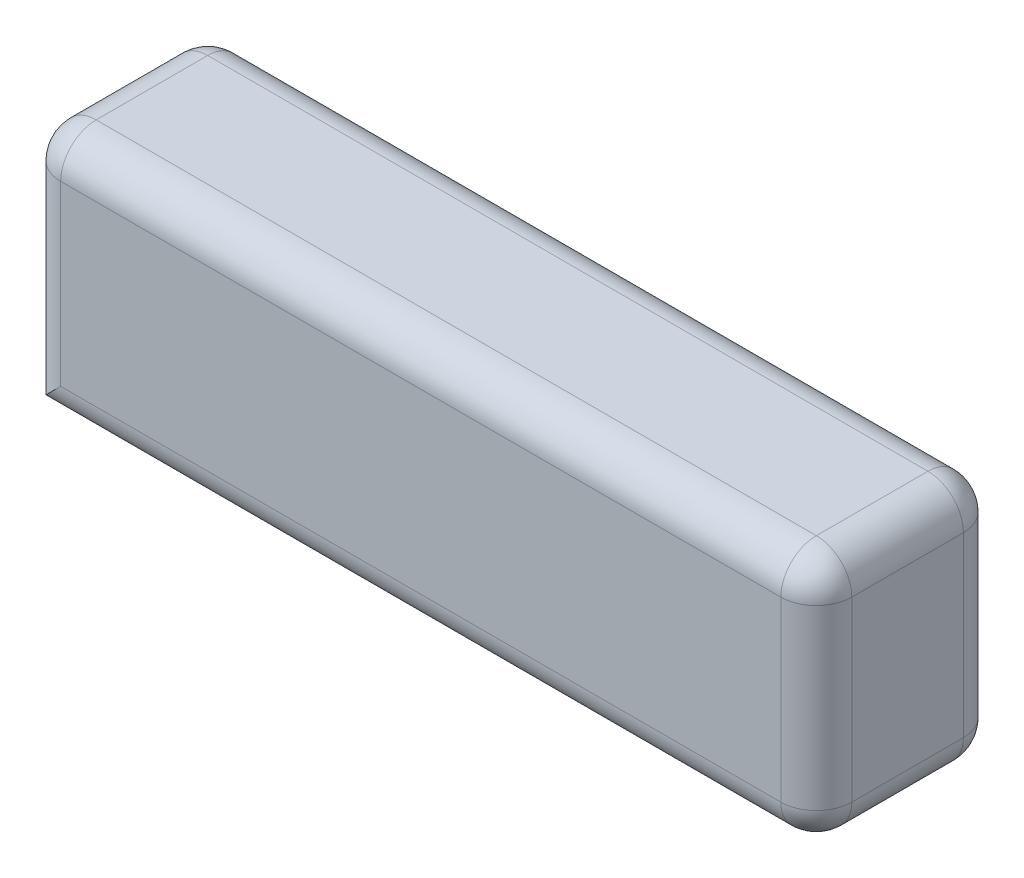
ISO-10303-21;
HEADER;
FILE_DESCRIPTION(('STEP AP214'),'2;1');
FILE_NAME('part.step','',(''),(''),'','','');
FILE_SCHEMA(('AUTOMOTIVE_DESIGN { 1 0 10303 214 1 1 1 1 }'));
ENDSEC;
DATA;
#1=APPLICATION_CONTEXT('core data for automotive mechanical design processes');
#2=APPLICATION_PROTOCOL_DEFINITION('international standard','automotive_design',2000,#1);
#3=PRODUCT_CONTEXT('',#1,'mechanical');
#4=PRODUCT('Part','Part','',(#3));
#5=PRODUCT_RELATED_PRODUCT_CATEGORY('part','',(#4));
#6=PRODUCT_DEFINITION_FORMATION('','',#4);
#7=PRODUCT_DEFINITION_CONTEXT('part definition',#1,'design');
#8=PRODUCT_DEFINITION('design','',#6,#7);
#9=PRODUCT_DEFINITION_SHAPE('','',#8);
#10=(LENGTH_UNIT() NAMED_UNIT(*) SI_UNIT(.MILLI.,.METRE.));
#11=(NAMED_UNIT(*) PLANE_ANGLE_UNIT() SI_UNIT($,.RADIAN.));
#12=(NAMED_UNIT(*) SI_UNIT($,.STERADIAN.) SOLID_ANGLE_UNIT());
#13=UNCERTAINTY_MEASURE_WITH_UNIT(LENGTH_MEASURE(1.E-05),#10,'distance_accuracy_value','');
#14=(GEOMETRIC_REPRESENTATION_CONTEXT(3) GLOBAL_UNCERTAINTY_ASSIGNED_CONTEXT((#13)) GLOBAL_UNIT_ASSIGNED_CONTEXT((#10,
#11,#12)) REPRESENTATION_CONTEXT('',''));
#15=CARTESIAN_POINT('',(0.,0.,0.));
#16=DIRECTION('',(0.,0.,1.));
#17=DIRECTION('',(1.,0.,0.));
#18=AXIS2_PLACEMENT_3D('',#15,#16,#17);
#19=CARTESIAN_POINT('',(0.,0.,36.));
#20=DIRECTION('',(1.,0.,0.));
#21=DIRECTION('',(0.,0.,-1.));
#22=AXIS2_PLACEMENT_3D('',#19,#20,#21);
#23=PLANE('',#22);
#24=DIRECTION('',(0.,0.,-1.));
#25=VECTOR('',#24,1.);
#26=CARTESIAN_POINT('',(0.,42.,36.));
#27=LINE('',#26,#25);
#28=CARTESIAN_POINT('',(0.,42.,29.));
#29=VERTEX_POINT('',#28);
#30=CARTESIAN_POINT('',(0.,42.,7.));
#31=VERTEX_POINT('',#30);
#32=EDGE_CURVE('E154',#29,#31,#27,.T.);
#33=ORIENTED_EDGE('',*,*,#32,.T.);
#34=DIRECTION('',(0.,-1.,0.));
#35=VECTOR('',#34,1.);
#36=CARTESIAN_POINT('',(0.,0.,7.));
#37=LINE('',#36,#35);
#38=CARTESIAN_POINT('',(0.,0.,7.));
#39=VERTEX_POINT('',#38);
#40=EDGE_CURVE('E138',#31,#39,#37,.T.);
#41=ORIENTED_EDGE('',*,*,#40,.T.);
#42=DIRECTION('',(0.,0.,-1.));
#43=VECTOR('',#42,1.);
#44=CARTESIAN_POINT('',(0.,0.,36.));
#45=LINE('',#44,#43);
#46=CARTESIAN_POINT('',(0.,0.,29.));
#47=VERTEX_POINT('',#46);
#48=EDGE_CURVE('E123',#47,#39,#45,.T.);
#49=ORIENTED_EDGE('',*,*,#48,.F.);
#50=DIRECTION('',(0.,-1.,0.));
#51=VECTOR('',#50,1.);
#52=CARTESIAN_POINT('',(0.,0.,29.));
#53=LINE('',#52,#51);
#54=EDGE_CURVE('E135',#47,#29,#53,.F.);
#55=ORIENTED_EDGE('',*,*,#54,.T.);
#56=EDGE_LOOP('',(#33,#41,#49,#55));
#57=FACE_BOUND('',#56,.T.);
#58=ADVANCED_FACE('F34',(#57),#23,.F.);
#59=CARTESIAN_POINT('',(0.,0.,36.));
#60=DIRECTION('',(0.,1.,0.));
#61=DIRECTION('',(0.,0.,1.));
#62=AXIS2_PLACEMENT_3D('',#59,#60,#61);
#63=PLANE('',#62);
#64=ORIENTED_EDGE('',*,*,#48,.T.);
#65=DIRECTION('',(1.,0.,0.));
#66=VECTOR('',#65,1.);
#67=CARTESIAN_POINT('',(156.,0.,7.));
#68=LINE('',#67,#66);
#69=CARTESIAN_POINT('',(149.,0.,7.));
#70=VERTEX_POINT('',#69);
#71=EDGE_CURVE('E130',#39,#70,#68,.T.);
#72=ORIENTED_EDGE('',*,*,#71,.T.);
#73=DIRECTION('',(0.,0.,-1.));
#74=VECTOR('',#73,1.);
#75=CARTESIAN_POINT('',(149.,0.,36.));
#76=LINE('',#75,#74);
#77=CARTESIAN_POINT('',(149.,0.,29.));
#78=VERTEX_POINT('',#77);
#79=EDGE_CURVE('E125',#70,#78,#76,.F.);
#80=ORIENTED_EDGE('',*,*,#79,.T.);
#81=DIRECTION('',(1.,0.,0.));
#82=VECTOR('',#81,1.);
#83=CARTESIAN_POINT('',(0.,0.,29.));
#84=LINE('',#83,#82);
#85=EDGE_CURVE('E120',#78,#47,#84,.F.);
#86=ORIENTED_EDGE('',*,*,#85,.T.);
#87=EDGE_LOOP('',(#64,#72,#80,#86));
#88=FACE_BOUND('',#87,.T.);
#89=ADVANCED_FACE('F122',(#88),#63,.F.);
#90=CARTESIAN_POINT('',(156.,0.,36.));
#91=DIRECTION('',(-1.,0.,0.));
#92=DIRECTION('',(0.,0.,1.));
#93=AXIS2_PLACEMENT_3D('',#90,#91,#92);
#94=PLANE('',#93);
#95=DIRECTION('',(0.,1.,0.));
#96=VECTOR('',#95,1.);
#97=CARTESIAN_POINT('',(156.,0.,29.));
#98=LINE('',#97,#96);
#99=CARTESIAN_POINT('',(156.,42.,29.));
#100=VERTEX_POINT('',#99);
#101=CARTESIAN_POINT('',(156.,7.,29.));
#102=VERTEX_POINT('',#101);
#103=EDGE_CURVE('E43',#100,#102,#98,.F.);
#104=ORIENTED_EDGE('',*,*,#103,.T.);
#105=DIRECTION('',(0.,0.,-1.));
#106=VECTOR('',#105,1.);
#107=CARTESIAN_POINT('',(156.,7.,36.));
#108=LINE('',#107,#106);
#109=CARTESIAN_POINT('',(156.,7.,7.));
#110=VERTEX_POINT('',#109);
#111=EDGE_CURVE('E11',#102,#110,#108,.T.);
#112=ORIENTED_EDGE('',*,*,#111,.T.);
#113=DIRECTION('',(0.,1.,0.));
#114=VECTOR('',#113,1.);
#115=CARTESIAN_POINT('',(156.,49.,7.));
#116=LINE('',#115,#114);
#117=CARTESIAN_POINT('',(156.,42.,7.));
#118=VERTEX_POINT('',#117);
#119=EDGE_CURVE('E188',#110,#118,#116,.T.);
#120=ORIENTED_EDGE('',*,*,#119,.T.);
#121=DIRECTION('',(0.,0.,-1.));
#122=VECTOR('',#121,1.);
#123=CARTESIAN_POINT('',(156.,42.,36.));
#124=LINE('',#123,#122);
#125=EDGE_CURVE('E186',#118,#100,#124,.F.);
#126=ORIENTED_EDGE('',*,*,#125,.T.);
#127=EDGE_LOOP('',(#104,#112,#120,#126));
#128=FACE_BOUND('',#127,.T.);
#129=ADVANCED_FACE('F260',(#128),#94,.F.);
#130=CARTESIAN_POINT('',(0.,49.,36.));
#131=DIRECTION('',(0.,-1.,0.));
#132=DIRECTION('',(0.,0.,-1.));
#133=AXIS2_PLACEMENT_3D('',#130,#131,#132);
#134=PLANE('',#133);
#135=DIRECTION('',(-1.,0.,0.));
#136=VECTOR('',#135,1.);
#137=CARTESIAN_POINT('',(0.,49.,7.));
#138=LINE('',#137,#136);
#139=CARTESIAN_POINT('',(149.,49.,7.));
#140=VERTEX_POINT('',#139);
#141=CARTESIAN_POINT('',(7.,49.,7.));
#142=VERTEX_POINT('',#141);
#143=EDGE_CURVE('E174',#140,#142,#138,.T.);
#144=ORIENTED_EDGE('',*,*,#143,.T.);
#145=DIRECTION('',(0.,0.,-1.));
#146=VECTOR('',#145,1.);
#147=CARTESIAN_POINT('',(7.,49.,36.));
#148=LINE('',#147,#146);
#149=CARTESIAN_POINT('',(7.,49.,29.));
#150=VERTEX_POINT('',#149);
#151=EDGE_CURVE('E176',#142,#150,#148,.F.);
#152=ORIENTED_EDGE('',*,*,#151,.T.);
#153=DIRECTION('',(-1.,0.,0.));
#154=VECTOR('',#153,1.);
#155=CARTESIAN_POINT('',(0.,49.,29.));
#156=LINE('',#155,#154);
#157=CARTESIAN_POINT('',(149.,49.,29.));
#158=VERTEX_POINT('',#157);
#159=EDGE_CURVE('E172',#150,#158,#156,.F.);
#160=ORIENTED_EDGE('',*,*,#159,.T.);
#161=DIRECTION('',(0.,0.,-1.));
#162=VECTOR('',#161,1.);
#163=CARTESIAN_POINT('',(149.,49.,36.));
#164=LINE('',#163,#162);
#165=EDGE_CURVE('E170',#158,#140,#164,.T.);
#166=ORIENTED_EDGE('',*,*,#165,.T.);
#167=EDGE_LOOP('',(#144,#152,#160,#166));
#168=FACE_BOUND('',#167,.T.);
#169=ADVANCED_FACE('F252',(#168),#134,.F.);
#170=CARTESIAN_POINT('',(0.,0.,36.));
#171=DIRECTION('',(0.,0.,-1.));
#172=DIRECTION('',(-1.,0.,0.));
#173=AXIS2_PLACEMENT_3D('',#170,#171,#172);
#174=PLANE('',#173);
#175=DIRECTION('',(-1.,0.,0.));
#176=VECTOR('',#175,1.);
#177=CARTESIAN_POINT('',(0.,42.,36.));
#178=LINE('',#177,#176);
#179=CARTESIAN_POINT('',(149.,42.,36.));
#180=VERTEX_POINT('',#179);
#181=CARTESIAN_POINT('',(7.,42.,36.));
#182=VERTEX_POINT('',#181);
#183=EDGE_CURVE('E179',#180,#182,#178,.T.);
#184=ORIENTED_EDGE('',*,*,#183,.T.);
#185=DIRECTION('',(0.,-1.,0.));
#186=VECTOR('',#185,1.);
#187=CARTESIAN_POINT('',(7.,0.,36.));
#188=LINE('',#187,#186);
#189=CARTESIAN_POINT('',(7.,7.,36.));
#190=VERTEX_POINT('',#189);
#191=EDGE_CURVE('E184',#182,#190,#188,.T.);
#192=ORIENTED_EDGE('',*,*,#191,.T.);
#193=DIRECTION('',(1.,0.,0.));
#194=VECTOR('',#193,1.);
#195=CARTESIAN_POINT('',(0.,7.,36.));
#196=LINE('',#195,#194);
#197=CARTESIAN_POINT('',(149.,7.,36.));
#198=VERTEX_POINT('',#197);
#199=EDGE_CURVE('E143',#190,#198,#196,.T.);
#200=ORIENTED_EDGE('',*,*,#199,.T.);
#201=DIRECTION('',(0.,1.,0.));
#202=VECTOR('',#201,1.);
#203=CARTESIAN_POINT('',(149.,0.,36.));
#204=LINE('',#203,#202);
#205=EDGE_CURVE('E181',#198,#180,#204,.T.);
#206=ORIENTED_EDGE('',*,*,#205,.T.);
#207=EDGE_LOOP('',(#184,#192,#200,#206));
#208=FACE_BOUND('',#207,.T.);
#209=ADVANCED_FACE('F249',(#208),#174,.F.);
#210=CARTESIAN_POINT('',(0.,0.,0.));
#211=DIRECTION('',(0.,0.,-1.));
#212=DIRECTION('',(-1.,0.,0.));
#213=AXIS2_PLACEMENT_3D('',#210,#211,#212);
#214=PLANE('',#213);
#215=DIRECTION('',(1.,0.,0.));
#216=VECTOR('',#215,1.);
#217=CARTESIAN_POINT('',(0.,7.,0.));
#218=LINE('',#217,#216);
#219=CARTESIAN_POINT('',(149.,7.,0.));
#220=VERTEX_POINT('',#219);
#221=CARTESIAN_POINT('',(7.,7.,0.));
#222=VERTEX_POINT('',#221);
#223=EDGE_CURVE('E163',#220,#222,#218,.F.);
#224=ORIENTED_EDGE('',*,*,#223,.T.);
#225=DIRECTION('',(0.,-1.,0.));
#226=VECTOR('',#225,1.);
#227=CARTESIAN_POINT('',(7.,49.,0.));
#228=LINE('',#227,#226);
#229=CARTESIAN_POINT('',(7.,42.,0.));
#230=VERTEX_POINT('',#229);
#231=EDGE_CURVE('E165',#222,#230,#228,.F.);
#232=ORIENTED_EDGE('',*,*,#231,.T.);
#233=DIRECTION('',(-1.,0.,0.));
#234=VECTOR('',#233,1.);
#235=CARTESIAN_POINT('',(156.,42.,0.));
#236=LINE('',#235,#234);
#237=CARTESIAN_POINT('',(149.,42.,0.));
#238=VERTEX_POINT('',#237);
#239=EDGE_CURVE('E159',#230,#238,#236,.F.);
#240=ORIENTED_EDGE('',*,*,#239,.T.);
#241=DIRECTION('',(0.,1.,0.));
#242=VECTOR('',#241,1.);
#243=CARTESIAN_POINT('',(149.,0.,0.));
#244=LINE('',#243,#242);
#245=EDGE_CURVE('E161',#238,#220,#244,.F.);
#246=ORIENTED_EDGE('',*,*,#245,.T.);
#247=EDGE_LOOP('',(#224,#232,#240,#246));
#248=FACE_BOUND('',#247,.T.);
#249=ADVANCED_FACE('F251',(#248),#214,.T.);
#250=CARTESIAN_POINT('',(149.,42.,29.));
#251=DIRECTION('',(0.,0.,1.));
#252=DIRECTION('',(1.,0.,0.));
#253=AXIS2_PLACEMENT_3D('',#250,#251,#252);
#254=SPHERICAL_SURFACE('',#253,7.);
#255=CARTESIAN_POINT('',(149.,42.,29.));
#256=DIRECTION('',(1.,0.,0.));
#257=DIRECTION('',(0.,0.,-1.));
#258=AXIS2_PLACEMENT_3D('',#255,#256,#257);
#259=CIRCLE('',#258,7.);
#260=EDGE_CURVE('E147',#180,#158,#259,.F.);
#261=ORIENTED_EDGE('',*,*,#260,.F.);
#262=CARTESIAN_POINT('',(149.,42.,29.));
#263=DIRECTION('',(0.,1.,0.));
#264=DIRECTION('',(0.,0.,1.));
#265=AXIS2_PLACEMENT_3D('',#262,#263,#264);
#266=CIRCLE('',#265,7.);
#267=EDGE_CURVE('E38',#100,#180,#266,.F.);
#268=ORIENTED_EDGE('',*,*,#267,.F.);
#269=CARTESIAN_POINT('',(149.,42.,29.));
#270=DIRECTION('',(0.,0.,1.));
#271=DIRECTION('',(1.,0.,0.));
#272=AXIS2_PLACEMENT_3D('',#269,#270,#271);
#273=CIRCLE('',#272,7.);
#274=EDGE_CURVE('E230',#158,#100,#273,.F.);
#275=ORIENTED_EDGE('',*,*,#274,.F.);
#276=EDGE_LOOP('',(#261,#268,#275));
#277=FACE_BOUND('',#276,.T.);
#278=ADVANCED_FACE('F36',(#277),#254,.T.);
#279=CARTESIAN_POINT('',(0.,7.,29.));
#280=DIRECTION('',(1.,0.,0.));
#281=DIRECTION('',(0.,0.,-1.));
#282=AXIS2_PLACEMENT_3D('',#279,#280,#281);
#283=CYLINDRICAL_SURFACE('',#282,7.);
#284=CARTESIAN_POINT('',(149.,7.,29.));
#285=DIRECTION('',(1.,0.,0.));
#286=DIRECTION('',(0.,0.,-1.));
#287=AXIS2_PLACEMENT_3D('',#284,#285,#286);
#288=CIRCLE('',#287,7.);
#289=EDGE_CURVE('E148',#198,#78,#288,.T.);
#290=ORIENTED_EDGE('',*,*,#289,.F.);
#291=ORIENTED_EDGE('',*,*,#199,.F.);
#292=CARTESIAN_POINT('',(7.,7.,29.));
#293=DIRECTION('',(0.707106781186547,-0.707106781186547,0.));
#294=DIRECTION('',(0.707106781186547,0.707106781186547,0.));
#295=AXIS2_PLACEMENT_3D('',#292,#293,#294);
#296=ELLIPSE('',#295,9.89949493661167,7.);
#297=EDGE_CURVE('E141',#47,#190,#296,.F.);
#298=ORIENTED_EDGE('',*,*,#297,.F.);
#299=ORIENTED_EDGE('',*,*,#85,.F.);
#300=EDGE_LOOP('',(#290,#291,#298,#299));
#301=FACE_BOUND('',#300,.T.);
#302=ADVANCED_FACE('F142',(#301),#283,.T.);
#303=CARTESIAN_POINT('',(149.,0.,29.));
#304=DIRECTION('',(0.,1.,0.));
#305=DIRECTION('',(0.,0.,1.));
#306=AXIS2_PLACEMENT_3D('',#303,#304,#305);
#307=CYLINDRICAL_SURFACE('',#306,7.);
#308=ORIENTED_EDGE('',*,*,#267,.T.);
#309=ORIENTED_EDGE('',*,*,#205,.F.);
#310=CARTESIAN_POINT('',(149.,7.,29.));
#311=DIRECTION('',(0.,-1.,0.));
#312=DIRECTION('',(0.,0.,-1.));
#313=AXIS2_PLACEMENT_3D('',#310,#311,#312);
#314=CIRCLE('',#313,7.);
#315=EDGE_CURVE('E225',#102,#198,#314,.T.);
#316=ORIENTED_EDGE('',*,*,#315,.F.);
#317=ORIENTED_EDGE('',*,*,#103,.F.);
#318=EDGE_LOOP('',(#308,#309,#316,#317));
#319=FACE_BOUND('',#318,.T.);
#320=ADVANCED_FACE('F241',(#319),#307,.T.);
#321=CARTESIAN_POINT('',(149.,42.,36.));
#322=DIRECTION('',(0.,0.,-1.));
#323=DIRECTION('',(-1.,0.,0.));
#324=AXIS2_PLACEMENT_3D('',#321,#322,#323);
#325=CYLINDRICAL_SURFACE('',#324,7.);
#326=ORIENTED_EDGE('',*,*,#274,.T.);
#327=ORIENTED_EDGE('',*,*,#125,.F.);
#328=CARTESIAN_POINT('',(149.,42.,7.));
#329=DIRECTION('',(0.,0.,-1.));
#330=DIRECTION('',(-1.,0.,0.));
#331=AXIS2_PLACEMENT_3D('',#328,#329,#330);
#332=CIRCLE('',#331,7.);
#333=EDGE_CURVE('E222',#140,#118,#332,.T.);
#334=ORIENTED_EDGE('',*,*,#333,.F.);
#335=ORIENTED_EDGE('',*,*,#165,.F.);
#336=EDGE_LOOP('',(#326,#327,#334,#335));
#337=FACE_BOUND('',#336,.T.);
#338=ADVANCED_FACE('F318',(#337),#325,.T.);
#339=CARTESIAN_POINT('',(0.,42.,29.));
#340=DIRECTION('',(-1.,0.,0.));
#341=DIRECTION('',(0.,0.,1.));
#342=AXIS2_PLACEMENT_3D('',#339,#340,#341);
#343=CYLINDRICAL_SURFACE('',#342,7.);
#344=ORIENTED_EDGE('',*,*,#260,.T.);
#345=ORIENTED_EDGE('',*,*,#159,.F.);
#346=CARTESIAN_POINT('',(7.,42.,29.));
#347=DIRECTION('',(-1.,0.,0.));
#348=DIRECTION('',(0.,0.,1.));
#349=AXIS2_PLACEMENT_3D('',#346,#347,#348);
#350=CIRCLE('',#349,7.);
#351=EDGE_CURVE('E219',#182,#150,#350,.T.);
#352=ORIENTED_EDGE('',*,*,#351,.F.);
#353=ORIENTED_EDGE('',*,*,#183,.F.);
#354=EDGE_LOOP('',(#344,#345,#352,#353));
#355=FACE_BOUND('',#354,.T.);
#356=ADVANCED_FACE('F247',(#355),#343,.T.);
#357=CARTESIAN_POINT('',(7.,0.,29.));
#358=DIRECTION('',(0.,-1.,0.));
#359=DIRECTION('',(0.,0.,-1.));
#360=AXIS2_PLACEMENT_3D('',#357,#358,#359);
#361=CYLINDRICAL_SURFACE('',#360,7.);
#362=ORIENTED_EDGE('',*,*,#297,.T.);
#363=ORIENTED_EDGE('',*,*,#191,.F.);
#364=CARTESIAN_POINT('',(7.,42.,29.));
#365=DIRECTION('',(0.,1.,0.));
#366=DIRECTION('',(0.,0.,1.));
#367=AXIS2_PLACEMENT_3D('',#364,#365,#366);
#368=CIRCLE('',#367,7.);
#369=EDGE_CURVE('E152',#29,#182,#368,.T.);
#370=ORIENTED_EDGE('',*,*,#369,.F.);
#371=ORIENTED_EDGE('',*,*,#54,.F.);
#372=EDGE_LOOP('',(#362,#363,#370,#371));
#373=FACE_BOUND('',#372,.T.);
#374=ADVANCED_FACE('F150',(#373),#361,.T.);
#375=CARTESIAN_POINT('',(149.,7.,29.));
#376=DIRECTION('',(0.,0.,1.));
#377=DIRECTION('',(1.,0.,0.));
#378=AXIS2_PLACEMENT_3D('',#375,#376,#377);
#379=SPHERICAL_SURFACE('',#378,7.);
#380=ORIENTED_EDGE('',*,*,#315,.T.);
#381=ORIENTED_EDGE('',*,*,#289,.T.);
#382=CARTESIAN_POINT('',(149.,7.,29.));
#383=DIRECTION('',(0.,0.,1.));
#384=DIRECTION('',(1.,0.,0.));
#385=AXIS2_PLACEMENT_3D('',#382,#383,#384);
#386=CIRCLE('',#385,7.);
#387=EDGE_CURVE('E215',#102,#78,#386,.F.);
#388=ORIENTED_EDGE('',*,*,#387,.F.);
#389=EDGE_LOOP('',(#380,#381,#388));
#390=FACE_BOUND('',#389,.T.);
#391=ADVANCED_FACE('F309',(#390),#379,.T.);
#392=CARTESIAN_POINT('',(149.,42.,7.));
#393=DIRECTION('',(0.,0.,1.));
#394=DIRECTION('',(1.,0.,0.));
#395=AXIS2_PLACEMENT_3D('',#392,#393,#394);
#396=SPHERICAL_SURFACE('',#395,7.);
#397=CARTESIAN_POINT('',(149.,42.,7.));
#398=DIRECTION('',(1.,0.,0.));
#399=DIRECTION('',(0.,0.,-1.));
#400=AXIS2_PLACEMENT_3D('',#397,#398,#399);
#401=CIRCLE('',#400,7.);
#402=EDGE_CURVE('E209',#140,#238,#401,.F.);
#403=ORIENTED_EDGE('',*,*,#402,.F.);
#404=ORIENTED_EDGE('',*,*,#333,.T.);
#405=CARTESIAN_POINT('',(149.,42.,7.));
#406=DIRECTION('',(0.,1.,0.));
#407=DIRECTION('',(0.,0.,1.));
#408=AXIS2_PLACEMENT_3D('',#405,#406,#407);
#409=CIRCLE('',#408,7.);
#410=EDGE_CURVE('E212',#238,#118,#409,.F.);
#411=ORIENTED_EDGE('',*,*,#410,.F.);
#412=EDGE_LOOP('',(#403,#404,#411));
#413=FACE_BOUND('',#412,.T.);
#414=ADVANCED_FACE('F305',(#413),#396,.T.);
#415=CARTESIAN_POINT('',(7.,42.,29.));
#416=DIRECTION('',(0.,0.,1.));
#417=DIRECTION('',(1.,0.,0.));
#418=AXIS2_PLACEMENT_3D('',#415,#416,#417);
#419=SPHERICAL_SURFACE('',#418,7.);
#420=ORIENTED_EDGE('',*,*,#369,.T.);
#421=ORIENTED_EDGE('',*,*,#351,.T.);
#422=CARTESIAN_POINT('',(7.,42.,29.));
#423=DIRECTION('',(0.,0.,1.));
#424=DIRECTION('',(1.,0.,0.));
#425=AXIS2_PLACEMENT_3D('',#422,#423,#424);
#426=CIRCLE('',#425,7.);
#427=EDGE_CURVE('E207',#29,#150,#426,.F.);
#428=ORIENTED_EDGE('',*,*,#427,.F.);
#429=EDGE_LOOP('',(#420,#421,#428));
#430=FACE_BOUND('',#429,.T.);
#431=ADVANCED_FACE('F301',(#430),#419,.T.);
#432=CARTESIAN_POINT('',(149.,7.,36.));
#433=DIRECTION('',(0.,0.,-1.));
#434=DIRECTION('',(-1.,0.,0.));
#435=AXIS2_PLACEMENT_3D('',#432,#433,#434);
#436=CYLINDRICAL_SURFACE('',#435,7.);
#437=ORIENTED_EDGE('',*,*,#387,.T.);
#438=ORIENTED_EDGE('',*,*,#79,.F.);
#439=CARTESIAN_POINT('',(149.,7.,7.));
#440=DIRECTION('',(0.,0.,-1.));
#441=DIRECTION('',(-1.,0.,0.));
#442=AXIS2_PLACEMENT_3D('',#439,#440,#441);
#443=CIRCLE('',#442,7.);
#444=EDGE_CURVE('E205',#110,#70,#443,.T.);
#445=ORIENTED_EDGE('',*,*,#444,.F.);
#446=ORIENTED_EDGE('',*,*,#111,.F.);
#447=EDGE_LOOP('',(#437,#438,#445,#446));
#448=FACE_BOUND('',#447,.T.);
#449=ADVANCED_FACE('F297',(#448),#436,.T.);
#450=CARTESIAN_POINT('',(149.,0.,7.));
#451=DIRECTION('',(0.,-1.,0.));
#452=DIRECTION('',(0.,0.,-1.));
#453=AXIS2_PLACEMENT_3D('',#450,#451,#452);
#454=CYLINDRICAL_SURFACE('',#453,7.);
#455=ORIENTED_EDGE('',*,*,#410,.T.);
#456=ORIENTED_EDGE('',*,*,#119,.F.);
#457=CARTESIAN_POINT('',(149.,7.,7.));
#458=DIRECTION('',(0.,-1.,0.));
#459=DIRECTION('',(0.,0.,-1.));
#460=AXIS2_PLACEMENT_3D('',#457,#458,#459);
#461=CIRCLE('',#460,7.);
#462=EDGE_CURVE('E57',#220,#110,#461,.T.);
#463=ORIENTED_EDGE('',*,*,#462,.F.);
#464=ORIENTED_EDGE('',*,*,#245,.F.);
#465=EDGE_LOOP('',(#455,#456,#463,#464));
#466=FACE_BOUND('',#465,.T.);
#467=ADVANCED_FACE('F293',(#466),#454,.T.);
#468=CARTESIAN_POINT('',(0.,42.,7.));
#469=DIRECTION('',(1.,0.,0.));
#470=DIRECTION('',(0.,0.,-1.));
#471=AXIS2_PLACEMENT_3D('',#468,#469,#470);
#472=CYLINDRICAL_SURFACE('',#471,7.);
#473=ORIENTED_EDGE('',*,*,#402,.T.);
#474=ORIENTED_EDGE('',*,*,#239,.F.);
#475=CARTESIAN_POINT('',(7.,42.,7.));
#476=DIRECTION('',(-1.,0.,0.));
#477=DIRECTION('',(0.,0.,1.));
#478=AXIS2_PLACEMENT_3D('',#475,#476,#477);
#479=CIRCLE('',#478,7.);
#480=EDGE_CURVE('E201',#142,#230,#479,.T.);
#481=ORIENTED_EDGE('',*,*,#480,.F.);
#482=ORIENTED_EDGE('',*,*,#143,.F.);
#483=EDGE_LOOP('',(#473,#474,#481,#482));
#484=FACE_BOUND('',#483,.T.);
#485=ADVANCED_FACE('F289',(#484),#472,.T.);
#486=CARTESIAN_POINT('',(7.,42.,36.));
#487=DIRECTION('',(0.,0.,-1.));
#488=DIRECTION('',(-1.,0.,0.));
#489=AXIS2_PLACEMENT_3D('',#486,#487,#488);
#490=CYLINDRICAL_SURFACE('',#489,7.);
#491=ORIENTED_EDGE('',*,*,#427,.T.);
#492=ORIENTED_EDGE('',*,*,#151,.F.);
#493=CARTESIAN_POINT('',(7.,42.,7.));
#494=DIRECTION('',(0.,0.,-1.));
#495=DIRECTION('',(-1.,0.,0.));
#496=AXIS2_PLACEMENT_3D('',#493,#494,#495);
#497=CIRCLE('',#496,7.);
#498=EDGE_CURVE('E198',#31,#142,#497,.T.);
#499=ORIENTED_EDGE('',*,*,#498,.F.);
#500=ORIENTED_EDGE('',*,*,#32,.F.);
#501=EDGE_LOOP('',(#491,#492,#499,#500));
#502=FACE_BOUND('',#501,.T.);
#503=ADVANCED_FACE('F286',(#502),#490,.T.);
#504=CARTESIAN_POINT('',(149.,7.,7.));
#505=DIRECTION('',(0.,0.,1.));
#506=DIRECTION('',(1.,0.,0.));
#507=AXIS2_PLACEMENT_3D('',#504,#505,#506);
#508=SPHERICAL_SURFACE('',#507,7.);
#509=ORIENTED_EDGE('',*,*,#462,.T.);
#510=ORIENTED_EDGE('',*,*,#444,.T.);
#511=CARTESIAN_POINT('',(149.,7.,7.));
#512=DIRECTION('',(1.,0.,0.));
#513=DIRECTION('',(0.,0.,-1.));
#514=AXIS2_PLACEMENT_3D('',#511,#512,#513);
#515=CIRCLE('',#514,7.);
#516=EDGE_CURVE('E195',#220,#70,#515,.F.);
#517=ORIENTED_EDGE('',*,*,#516,.F.);
#518=EDGE_LOOP('',(#509,#510,#517));
#519=FACE_BOUND('',#518,.T.);
#520=ADVANCED_FACE('F282',(#519),#508,.T.);
#521=CARTESIAN_POINT('',(7.,42.,7.));
#522=DIRECTION('',(0.,0.,1.));
#523=DIRECTION('',(1.,0.,0.));
#524=AXIS2_PLACEMENT_3D('',#521,#522,#523);
#525=SPHERICAL_SURFACE('',#524,7.);
#526=ORIENTED_EDGE('',*,*,#498,.T.);
#527=ORIENTED_EDGE('',*,*,#480,.T.);
#528=CARTESIAN_POINT('',(7.,42.,7.));
#529=DIRECTION('',(0.,1.,0.));
#530=DIRECTION('',(0.,0.,1.));
#531=AXIS2_PLACEMENT_3D('',#528,#529,#530);
#532=CIRCLE('',#531,7.);
#533=EDGE_CURVE('E193',#31,#230,#532,.F.);
#534=ORIENTED_EDGE('',*,*,#533,.F.);
#535=EDGE_LOOP('',(#526,#527,#534));
#536=FACE_BOUND('',#535,.T.);
#537=ADVANCED_FACE('F278',(#536),#525,.T.);
#538=CARTESIAN_POINT('',(0.,7.,7.));
#539=DIRECTION('',(-1.,0.,0.));
#540=DIRECTION('',(0.,0.,1.));
#541=AXIS2_PLACEMENT_3D('',#538,#539,#540);
#542=CYLINDRICAL_SURFACE('',#541,7.);
#543=ORIENTED_EDGE('',*,*,#516,.T.);
#544=ORIENTED_EDGE('',*,*,#71,.F.);
#545=CARTESIAN_POINT('',(7.,7.,7.));
#546=DIRECTION('',(-0.707106781186547,0.707106781186547,0.));
#547=DIRECTION('',(-0.707106781186547,-0.707106781186547,0.));
#548=AXIS2_PLACEMENT_3D('',#545,#546,#547);
#549=ELLIPSE('',#548,9.89949493661167,7.);
#550=EDGE_CURVE('E191',#222,#39,#549,.T.);
#551=ORIENTED_EDGE('',*,*,#550,.F.);
#552=ORIENTED_EDGE('',*,*,#223,.F.);
#553=EDGE_LOOP('',(#543,#544,#551,#552));
#554=FACE_BOUND('',#553,.T.);
#555=ADVANCED_FACE('F274',(#554),#542,.T.);
#556=CARTESIAN_POINT('',(7.,0.,7.));
#557=DIRECTION('',(0.,1.,0.));
#558=DIRECTION('',(0.,0.,1.));
#559=AXIS2_PLACEMENT_3D('',#556,#557,#558);
#560=CYLINDRICAL_SURFACE('',#559,7.);
#561=ORIENTED_EDGE('',*,*,#533,.T.);
#562=ORIENTED_EDGE('',*,*,#231,.F.);
#563=ORIENTED_EDGE('',*,*,#550,.T.);
#564=ORIENTED_EDGE('',*,*,#40,.F.);
#565=EDGE_LOOP('',(#561,#562,#563,#564));
#566=FACE_BOUND('',#565,.T.);
#567=ADVANCED_FACE('F271',(#566),#560,.T.);
#568=CLOSED_SHELL('',(#58,#89,#129,#169,#209,#249,#278,#302,#320,#338,#356,#374,#391,#414,#431,
#449,#467,#485,#503,#520,#537,#555,#567));
#569=MANIFOLD_SOLID_BREP('B2',#568);
#570=ADVANCED_BREP_SHAPE_REPRESENTATION('',(#18,#569),#14);
#571=SHAPE_DEFINITION_REPRESENTATION(#9,#570);
ENDSEC;
END-ISO-10303-21;
